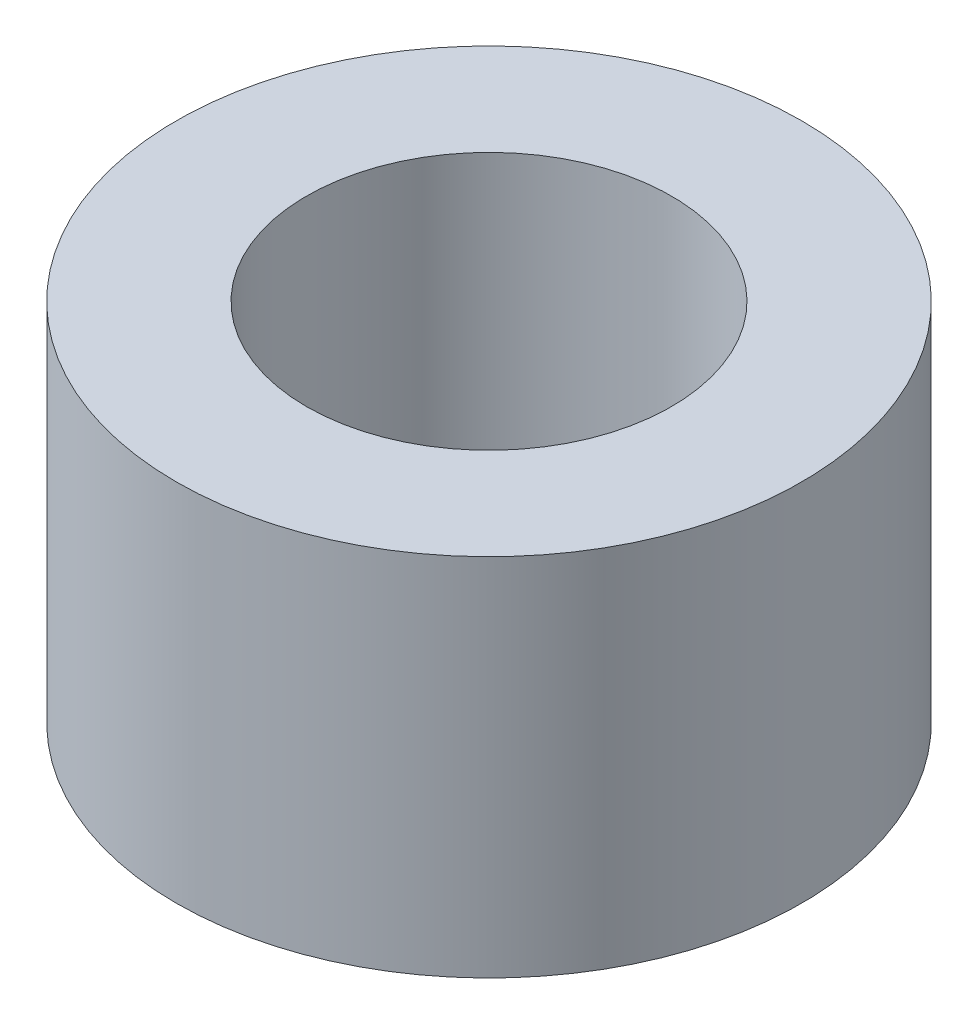
ISO-10303-21;
HEADER;
FILE_DESCRIPTION(('STEP AP214'),'2;1');
FILE_NAME('part.step','',(''),(''),'','','');
FILE_SCHEMA(('AUTOMOTIVE_DESIGN { 1 0 10303 214 1 1 1 1 }'));
ENDSEC;
DATA;
#1=APPLICATION_CONTEXT('core data for automotive mechanical design processes');
#2=APPLICATION_PROTOCOL_DEFINITION('international standard','automotive_design',2000,#1);
#3=PRODUCT_CONTEXT('',#1,'mechanical');
#4=PRODUCT('Part','Part','',(#3));
#5=PRODUCT_RELATED_PRODUCT_CATEGORY('part','',(#4));
#6=PRODUCT_DEFINITION_FORMATION('','',#4);
#7=PRODUCT_DEFINITION_CONTEXT('part definition',#1,'design');
#8=PRODUCT_DEFINITION('design','',#6,#7);
#9=PRODUCT_DEFINITION_SHAPE('','',#8);
#10=(LENGTH_UNIT() NAMED_UNIT(*) SI_UNIT(.MILLI.,.METRE.));
#11=(NAMED_UNIT(*) PLANE_ANGLE_UNIT() SI_UNIT($,.RADIAN.));
#12=(NAMED_UNIT(*) SI_UNIT($,.STERADIAN.) SOLID_ANGLE_UNIT());
#13=UNCERTAINTY_MEASURE_WITH_UNIT(LENGTH_MEASURE(1.E-05),#10,'distance_accuracy_value','');
#14=(GEOMETRIC_REPRESENTATION_CONTEXT(3) GLOBAL_UNCERTAINTY_ASSIGNED_CONTEXT((#13)) GLOBAL_UNIT_ASSIGNED_CONTEXT((#10,
#11,#12)) REPRESENTATION_CONTEXT('',''));
#15=CARTESIAN_POINT('',(0.,0.,0.));
#16=DIRECTION('',(0.,0.,1.));
#17=DIRECTION('',(1.,0.,0.));
#18=AXIS2_PLACEMENT_3D('',#15,#16,#17);
#19=CARTESIAN_POINT('',(0.,3.77958579881657,0.));
#20=DIRECTION('',(0.,1.,0.));
#21=DIRECTION('',(0.,0.,1.));
#22=AXIS2_PLACEMENT_3D('',#19,#20,#21);
#23=CYLINDRICAL_SURFACE('',#22,1.75);
#24=CARTESIAN_POINT('',(0.,0.,0.));
#25=DIRECTION('',(0.,1.,0.));
#26=DIRECTION('',(0.,0.,1.));
#27=AXIS2_PLACEMENT_3D('',#24,#25,#26);
#28=CIRCLE('',#27,1.75);
#29=CARTESIAN_POINT('',(0.,0.,1.75));
#30=VERTEX_POINT('',#29);
#31=EDGE_CURVE('E10',#30,#30,#28,.T.);
#32=ORIENTED_EDGE('',*,*,#31,.F.);
#33=EDGE_LOOP('',(#32));
#34=FACE_BOUND('',#33,.T.);
#35=CARTESIAN_POINT('',(0.,3.5,0.));
#36=DIRECTION('',(0.,1.,0.));
#37=DIRECTION('',(0.,0.,1.));
#38=AXIS2_PLACEMENT_3D('',#35,#36,#37);
#39=CIRCLE('',#38,1.75);
#40=CARTESIAN_POINT('',(0.,3.5,1.75));
#41=VERTEX_POINT('',#40);
#42=EDGE_CURVE('E53',#41,#41,#39,.T.);
#43=ORIENTED_EDGE('',*,*,#42,.T.);
#44=EDGE_LOOP('',(#43));
#45=FACE_BOUND('',#44,.T.);
#46=ADVANCED_FACE('F36',(#34,#45),#23,.F.);
#47=CARTESIAN_POINT('',(0.,0.,-1.75));
#48=DIRECTION('',(0.,1.,0.));
#49=DIRECTION('',(0.,0.,1.));
#50=AXIS2_PLACEMENT_3D('',#47,#48,#49);
#51=PLANE('',#50);
#52=CARTESIAN_POINT('',(0.,0.,0.));
#53=DIRECTION('',(0.,1.,0.));
#54=DIRECTION('',(0.,0.,1.));
#55=AXIS2_PLACEMENT_3D('',#52,#53,#54);
#56=CIRCLE('',#55,3.);
#57=CARTESIAN_POINT('',(0.,0.,3.));
#58=VERTEX_POINT('',#57);
#59=EDGE_CURVE('E43',#58,#58,#56,.T.);
#60=ORIENTED_EDGE('',*,*,#59,.F.);
#61=EDGE_LOOP('',(#60));
#62=FACE_BOUND('',#61,.T.);
#63=ORIENTED_EDGE('',*,*,#31,.T.);
#64=EDGE_LOOP('',(#63));
#65=FACE_BOUND('',#64,.T.);
#66=ADVANCED_FACE('F69',(#62,#65),#51,.F.);
#67=CARTESIAN_POINT('',(0.,3.77958579881657,0.));
#68=DIRECTION('',(0.,1.,0.));
#69=DIRECTION('',(0.,0.,1.));
#70=AXIS2_PLACEMENT_3D('',#67,#68,#69);
#71=CYLINDRICAL_SURFACE('',#70,3.);
#72=CARTESIAN_POINT('',(0.,3.5,0.));
#73=DIRECTION('',(0.,1.,0.));
#74=DIRECTION('',(0.,0.,1.));
#75=AXIS2_PLACEMENT_3D('',#72,#73,#74);
#76=CIRCLE('',#75,3.);
#77=CARTESIAN_POINT('',(0.,3.5,3.));
#78=VERTEX_POINT('',#77);
#79=EDGE_CURVE('E49',#78,#78,#76,.T.);
#80=ORIENTED_EDGE('',*,*,#79,.F.);
#81=EDGE_LOOP('',(#80));
#82=FACE_BOUND('',#81,.T.);
#83=ORIENTED_EDGE('',*,*,#59,.T.);
#84=EDGE_LOOP('',(#83));
#85=FACE_BOUND('',#84,.T.);
#86=ADVANCED_FACE('F64',(#82,#85),#71,.T.);
#87=CARTESIAN_POINT('',(0.,3.5,-1.75));
#88=DIRECTION('',(0.,-1.,0.));
#89=DIRECTION('',(0.,0.,-1.));
#90=AXIS2_PLACEMENT_3D('',#87,#88,#89);
#91=PLANE('',#90);
#92=ORIENTED_EDGE('',*,*,#42,.F.);
#93=EDGE_LOOP('',(#92));
#94=FACE_BOUND('',#93,.T.);
#95=ORIENTED_EDGE('',*,*,#79,.T.);
#96=EDGE_LOOP('',(#95));
#97=FACE_BOUND('',#96,.T.);
#98=ADVANCED_FACE('F61',(#94,#97),#91,.F.);
#99=CLOSED_SHELL('',(#46,#66,#86,#98));
#100=MANIFOLD_SOLID_BREP('B2',#99);
#101=ADVANCED_BREP_SHAPE_REPRESENTATION('',(#18,#100),#14);
#102=SHAPE_DEFINITION_REPRESENTATION(#9,#101);
ENDSEC;
END-ISO-10303-21;
